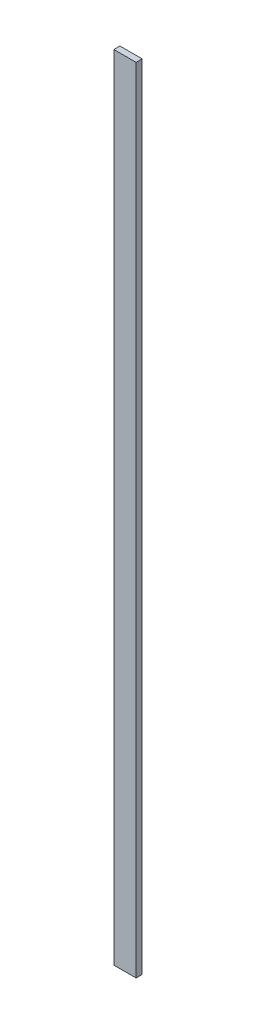
ISO-10303-21;
HEADER;
FILE_DESCRIPTION(('STEP AP214'),'2;1');
FILE_NAME('part.step','',(''),(''),'','','');
FILE_SCHEMA(('AUTOMOTIVE_DESIGN { 1 0 10303 214 1 1 1 1 }'));
ENDSEC;
DATA;
#1=APPLICATION_CONTEXT('core data for automotive mechanical design processes');
#2=APPLICATION_PROTOCOL_DEFINITION('international standard','automotive_design',2000,#1);
#3=PRODUCT_CONTEXT('',#1,'mechanical');
#4=PRODUCT('Part','Part','',(#3));
#5=PRODUCT_RELATED_PRODUCT_CATEGORY('part','',(#4));
#6=PRODUCT_DEFINITION_FORMATION('','',#4);
#7=PRODUCT_DEFINITION_CONTEXT('part definition',#1,'design');
#8=PRODUCT_DEFINITION('design','',#6,#7);
#9=PRODUCT_DEFINITION_SHAPE('','',#8);
#10=(LENGTH_UNIT() NAMED_UNIT(*) SI_UNIT(.MILLI.,.METRE.));
#11=(NAMED_UNIT(*) PLANE_ANGLE_UNIT() SI_UNIT($,.RADIAN.));
#12=(NAMED_UNIT(*) SI_UNIT($,.STERADIAN.) SOLID_ANGLE_UNIT());
#13=UNCERTAINTY_MEASURE_WITH_UNIT(LENGTH_MEASURE(1.E-05),#10,'distance_accuracy_value','');
#14=(GEOMETRIC_REPRESENTATION_CONTEXT(3) GLOBAL_UNCERTAINTY_ASSIGNED_CONTEXT((#13)) GLOBAL_UNIT_ASSIGNED_CONTEXT((#10,
#11,#12)) REPRESENTATION_CONTEXT('',''));
#15=CARTESIAN_POINT('',(0.,0.,0.));
#16=DIRECTION('',(0.,0.,1.));
#17=DIRECTION('',(1.,0.,0.));
#18=AXIS2_PLACEMENT_3D('',#15,#16,#17);
#19=CARTESIAN_POINT('',(-69.85,4978.4,19.05));
#20=DIRECTION('',(0.,0.,-1.));
#21=DIRECTION('',(-1.,0.,0.));
#22=AXIS2_PLACEMENT_3D('',#19,#20,#21);
#23=PLANE('',#22);
#24=DIRECTION('',(1.,0.,0.));
#25=VECTOR('',#24,1.);
#26=CARTESIAN_POINT('',(-69.85,0.,19.05));
#27=LINE('',#26,#25);
#28=CARTESIAN_POINT('',(-69.85,0.,19.05));
#29=VERTEX_POINT('',#28);
#30=CARTESIAN_POINT('',(69.85,0.,19.05));
#31=VERTEX_POINT('',#30);
#32=EDGE_CURVE('E102',#29,#31,#27,.T.);
#33=ORIENTED_EDGE('',*,*,#32,.T.);
#34=DIRECTION('',(0.,-1.,0.));
#35=VECTOR('',#34,1.);
#36=CARTESIAN_POINT('',(69.85,4978.4,19.05));
#37=LINE('',#36,#35);
#38=CARTESIAN_POINT('',(69.85,4978.4,19.05));
#39=VERTEX_POINT('',#38);
#40=EDGE_CURVE('E11',#39,#31,#37,.T.);
#41=ORIENTED_EDGE('',*,*,#40,.F.);
#42=DIRECTION('',(1.,0.,0.));
#43=VECTOR('',#42,1.);
#44=CARTESIAN_POINT('',(-69.85,4978.4,19.05));
#45=LINE('',#44,#43);
#46=CARTESIAN_POINT('',(-69.85,4978.4,19.05));
#47=VERTEX_POINT('',#46);
#48=EDGE_CURVE('E88',#47,#39,#45,.T.);
#49=ORIENTED_EDGE('',*,*,#48,.F.);
#50=DIRECTION('',(0.,-1.,0.));
#51=VECTOR('',#50,1.);
#52=CARTESIAN_POINT('',(-69.85,4978.4,19.05));
#53=LINE('',#52,#51);
#54=EDGE_CURVE('E55',#47,#29,#53,.T.);
#55=ORIENTED_EDGE('',*,*,#54,.T.);
#56=EDGE_LOOP('',(#33,#41,#49,#55));
#57=FACE_BOUND('',#56,.T.);
#58=ADVANCED_FACE('F39',(#57),#23,.F.);
#59=CARTESIAN_POINT('',(69.85,4978.4,19.05));
#60=DIRECTION('',(-1.,0.,0.));
#61=DIRECTION('',(0.,0.,1.));
#62=AXIS2_PLACEMENT_3D('',#59,#60,#61);
#63=PLANE('',#62);
#64=DIRECTION('',(0.,0.,-1.));
#65=VECTOR('',#64,1.);
#66=CARTESIAN_POINT('',(69.85,0.,19.05));
#67=LINE('',#66,#65);
#68=CARTESIAN_POINT('',(69.85,0.,-19.05));
#69=VERTEX_POINT('',#68);
#70=EDGE_CURVE('E93',#31,#69,#67,.T.);
#71=ORIENTED_EDGE('',*,*,#70,.T.);
#72=DIRECTION('',(0.,-1.,0.));
#73=VECTOR('',#72,1.);
#74=CARTESIAN_POINT('',(69.85,4978.4,-19.05));
#75=LINE('',#74,#73);
#76=CARTESIAN_POINT('',(69.85,4978.4,-19.05));
#77=VERTEX_POINT('',#76);
#78=EDGE_CURVE('E47',#77,#69,#75,.T.);
#79=ORIENTED_EDGE('',*,*,#78,.F.);
#80=DIRECTION('',(0.,0.,-1.));
#81=VECTOR('',#80,1.);
#82=CARTESIAN_POINT('',(69.85,4978.4,19.05));
#83=LINE('',#82,#81);
#84=EDGE_CURVE('E80',#39,#77,#83,.T.);
#85=ORIENTED_EDGE('',*,*,#84,.F.);
#86=ORIENTED_EDGE('',*,*,#40,.T.);
#87=EDGE_LOOP('',(#71,#79,#85,#86));
#88=FACE_BOUND('',#87,.T.);
#89=ADVANCED_FACE('F92',(#88),#63,.F.);
#90=CARTESIAN_POINT('',(-69.85,4978.4,-19.05));
#91=DIRECTION('',(0.,0.,-1.));
#92=DIRECTION('',(-1.,0.,0.));
#93=AXIS2_PLACEMENT_3D('',#90,#91,#92);
#94=PLANE('',#93);
#95=DIRECTION('',(1.,0.,0.));
#96=VECTOR('',#95,1.);
#97=CARTESIAN_POINT('',(-69.85,0.,-19.05));
#98=LINE('',#97,#96);
#99=CARTESIAN_POINT('',(-69.85,0.,-19.05));
#100=VERTEX_POINT('',#99);
#101=EDGE_CURVE('E105',#100,#69,#98,.T.);
#102=ORIENTED_EDGE('',*,*,#101,.F.);
#103=DIRECTION('',(0.,-1.,0.));
#104=VECTOR('',#103,1.);
#105=CARTESIAN_POINT('',(-69.85,4978.4,-19.05));
#106=LINE('',#105,#104);
#107=CARTESIAN_POINT('',(-69.85,4978.4,-19.05));
#108=VERTEX_POINT('',#107);
#109=EDGE_CURVE('E69',#108,#100,#106,.T.);
#110=ORIENTED_EDGE('',*,*,#109,.F.);
#111=DIRECTION('',(1.,0.,0.));
#112=VECTOR('',#111,1.);
#113=CARTESIAN_POINT('',(-69.85,4978.4,-19.05));
#114=LINE('',#113,#112);
#115=EDGE_CURVE('E87',#108,#77,#114,.T.);
#116=ORIENTED_EDGE('',*,*,#115,.T.);
#117=ORIENTED_EDGE('',*,*,#78,.T.);
#118=EDGE_LOOP('',(#102,#110,#116,#117));
#119=FACE_BOUND('',#118,.T.);
#120=ADVANCED_FACE('F96',(#119),#94,.T.);
#121=CARTESIAN_POINT('',(-69.85,4978.4,19.05));
#122=DIRECTION('',(-1.,0.,0.));
#123=DIRECTION('',(0.,0.,1.));
#124=AXIS2_PLACEMENT_3D('',#121,#122,#123);
#125=PLANE('',#124);
#126=DIRECTION('',(0.,0.,-1.));
#127=VECTOR('',#126,1.);
#128=CARTESIAN_POINT('',(-69.85,0.,19.05));
#129=LINE('',#128,#127);
#130=EDGE_CURVE('E107',#29,#100,#129,.T.);
#131=ORIENTED_EDGE('',*,*,#130,.F.);
#132=ORIENTED_EDGE('',*,*,#54,.F.);
#133=DIRECTION('',(0.,0.,-1.));
#134=VECTOR('',#133,1.);
#135=CARTESIAN_POINT('',(-69.85,4978.4,19.05));
#136=LINE('',#135,#134);
#137=EDGE_CURVE('E97',#47,#108,#136,.T.);
#138=ORIENTED_EDGE('',*,*,#137,.T.);
#139=ORIENTED_EDGE('',*,*,#109,.T.);
#140=EDGE_LOOP('',(#131,#132,#138,#139));
#141=FACE_BOUND('',#140,.T.);
#142=ADVANCED_FACE('F113',(#141),#125,.T.);
#143=CARTESIAN_POINT('',(0.,4978.4,0.));
#144=DIRECTION('',(0.,1.,0.));
#145=DIRECTION('',(0.,0.,1.));
#146=AXIS2_PLACEMENT_3D('',#143,#144,#145);
#147=PLANE('',#146);
#148=ORIENTED_EDGE('',*,*,#48,.T.);
#149=ORIENTED_EDGE('',*,*,#84,.T.);
#150=ORIENTED_EDGE('',*,*,#115,.F.);
#151=ORIENTED_EDGE('',*,*,#137,.F.);
#152=EDGE_LOOP('',(#148,#149,#150,#151));
#153=FACE_BOUND('',#152,.T.);
#154=ADVANCED_FACE('F84',(#153),#147,.T.);
#155=CARTESIAN_POINT('',(0.,0.,0.));
#156=DIRECTION('',(0.,1.,0.));
#157=DIRECTION('',(0.,0.,1.));
#158=AXIS2_PLACEMENT_3D('',#155,#156,#157);
#159=PLANE('',#158);
#160=ORIENTED_EDGE('',*,*,#32,.F.);
#161=ORIENTED_EDGE('',*,*,#130,.T.);
#162=ORIENTED_EDGE('',*,*,#101,.T.);
#163=ORIENTED_EDGE('',*,*,#70,.F.);
#164=EDGE_LOOP('',(#160,#161,#162,#163));
#165=FACE_BOUND('',#164,.T.);
#166=ADVANCED_FACE('F112',(#165),#159,.F.);
#167=CLOSED_SHELL('',(#58,#89,#120,#142,#154,#166));
#168=MANIFOLD_SOLID_BREP('B2',#167);
#169=ADVANCED_BREP_SHAPE_REPRESENTATION('',(#18,#168),#14);
#170=SHAPE_DEFINITION_REPRESENTATION(#9,#169);
ENDSEC;
END-ISO-10303-21;
